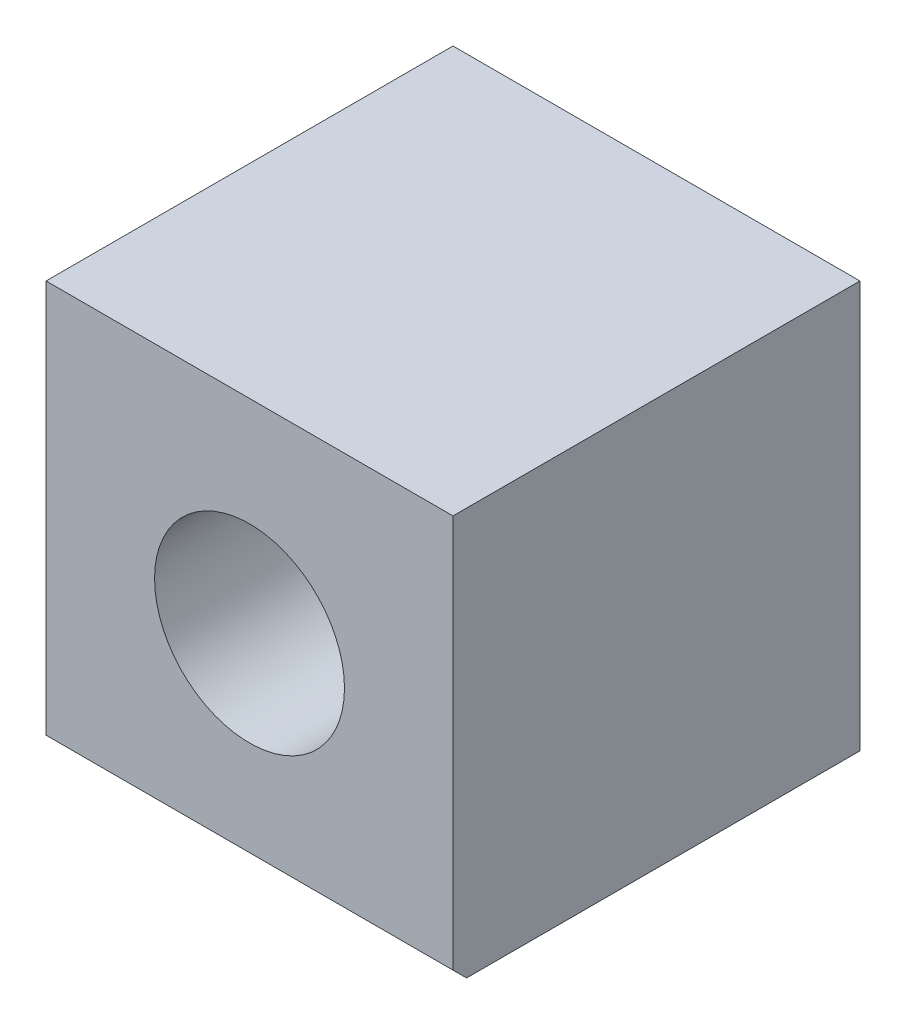
ISO-10303-21;
HEADER;
FILE_DESCRIPTION(('STEP AP214'),'2;1');
FILE_NAME('part.step','',(''),(''),'','','');
FILE_SCHEMA(('AUTOMOTIVE_DESIGN { 1 0 10303 214 1 1 1 1 }'));
ENDSEC;
DATA;
#1=APPLICATION_CONTEXT('core data for automotive mechanical design processes');
#2=APPLICATION_PROTOCOL_DEFINITION('international standard','automotive_design',2000,#1);
#3=PRODUCT_CONTEXT('',#1,'mechanical');
#4=PRODUCT('Part','Part','',(#3));
#5=PRODUCT_RELATED_PRODUCT_CATEGORY('part','',(#4));
#6=PRODUCT_DEFINITION_FORMATION('','',#4);
#7=PRODUCT_DEFINITION_CONTEXT('part definition',#1,'design');
#8=PRODUCT_DEFINITION('design','',#6,#7);
#9=PRODUCT_DEFINITION_SHAPE('','',#8);
#10=(LENGTH_UNIT() NAMED_UNIT(*) SI_UNIT(.MILLI.,.METRE.));
#11=(NAMED_UNIT(*) PLANE_ANGLE_UNIT() SI_UNIT($,.RADIAN.));
#12=(NAMED_UNIT(*) SI_UNIT($,.STERADIAN.) SOLID_ANGLE_UNIT());
#13=UNCERTAINTY_MEASURE_WITH_UNIT(LENGTH_MEASURE(1.E-05),#10,'distance_accuracy_value','');
#14=(GEOMETRIC_REPRESENTATION_CONTEXT(3) GLOBAL_UNCERTAINTY_ASSIGNED_CONTEXT((#13)) GLOBAL_UNIT_ASSIGNED_CONTEXT((#10,
#11,#12)) REPRESENTATION_CONTEXT('',''));
#15=CARTESIAN_POINT('',(0.,0.,0.));
#16=DIRECTION('',(0.,0.,1.));
#17=DIRECTION('',(1.,0.,0.));
#18=AXIS2_PLACEMENT_3D('',#15,#16,#17);
#19=CARTESIAN_POINT('',(-2.77884564684904,2.89301310043668,6.));
#20=DIRECTION('',(1.,0.,0.));
#21=DIRECTION('',(0.,1.,0.));
#22=AXIS2_PLACEMENT_3D('',#19,#20,#21);
#23=PLANE('',#22);
#24=DIRECTION('',(0.,0.,-1.));
#25=VECTOR('',#24,1.);
#26=CARTESIAN_POINT('',(-2.77884564684904,-3.10698689956332,6.));
#27=LINE('',#26,#25);
#28=CARTESIAN_POINT('',(-2.77884564684904,-3.10698689956332,5.8));
#29=VERTEX_POINT('',#28);
#30=CARTESIAN_POINT('',(-2.77884564684904,-3.10698689956332,0.));
#31=VERTEX_POINT('',#30);
#32=EDGE_CURVE('E11',#29,#31,#27,.T.);
#33=ORIENTED_EDGE('',*,*,#32,.F.);
#34=DIRECTION('',(0.,0.707106781186548,0.707106781186547));
#35=VECTOR('',#34,1.);
#36=CARTESIAN_POINT('',(-2.77884564684904,-2.90698689956332,6.));
#37=LINE('',#36,#35);
#38=CARTESIAN_POINT('',(-2.77884564684904,-2.90698689956332,6.));
#39=VERTEX_POINT('',#38);
#40=EDGE_CURVE('E118',#29,#39,#37,.T.);
#41=ORIENTED_EDGE('',*,*,#40,.T.);
#42=DIRECTION('',(0.,-1.,0.));
#43=VECTOR('',#42,1.);
#44=CARTESIAN_POINT('',(-2.77884564684904,2.89301310043668,6.));
#45=LINE('',#44,#43);
#46=CARTESIAN_POINT('',(-2.77884564684904,2.89301310043668,6.));
#47=VERTEX_POINT('',#46);
#48=EDGE_CURVE('E84',#47,#39,#45,.T.);
#49=ORIENTED_EDGE('',*,*,#48,.F.);
#50=DIRECTION('',(0.,0.,-1.));
#51=VECTOR('',#50,1.);
#52=CARTESIAN_POINT('',(-2.77884564684904,2.89301310043668,6.));
#53=LINE('',#52,#51);
#54=CARTESIAN_POINT('',(-2.77884564684904,2.89301310043668,0.));
#55=VERTEX_POINT('',#54);
#56=EDGE_CURVE('E77',#47,#55,#53,.T.);
#57=ORIENTED_EDGE('',*,*,#56,.T.);
#58=DIRECTION('',(0.,-1.,0.));
#59=VECTOR('',#58,1.);
#60=CARTESIAN_POINT('',(-2.77884564684904,2.89301310043668,0.));
#61=LINE('',#60,#59);
#62=EDGE_CURVE('E90',#55,#31,#61,.T.);
#63=ORIENTED_EDGE('',*,*,#62,.T.);
#64=EDGE_LOOP('',(#33,#41,#49,#57,#63));
#65=FACE_BOUND('',#64,.T.);
#66=ADVANCED_FACE('F33',(#65),#23,.F.);
#67=CARTESIAN_POINT('',(-2.77884564684904,-3.10698689956332,6.));
#68=DIRECTION('',(0.,1.,0.));
#69=DIRECTION('',(0.,0.,1.));
#70=AXIS2_PLACEMENT_3D('',#67,#68,#69);
#71=PLANE('',#70);
#72=DIRECTION('',(0.,0.,-1.));
#73=VECTOR('',#72,1.);
#74=CARTESIAN_POINT('',(3.22115435315096,-3.10698689956332,6.));
#75=LINE('',#74,#73);
#76=CARTESIAN_POINT('',(3.22115435315096,-3.10698689956332,5.8));
#77=VERTEX_POINT('',#76);
#78=CARTESIAN_POINT('',(3.22115435315096,-3.10698689956332,0.));
#79=VERTEX_POINT('',#78);
#80=EDGE_CURVE('E40',#77,#79,#75,.T.);
#81=ORIENTED_EDGE('',*,*,#80,.F.);
#82=DIRECTION('',(1.,0.,0.));
#83=VECTOR('',#82,1.);
#84=CARTESIAN_POINT('',(-2.77884564684904,-3.10698689956332,5.8));
#85=LINE('',#84,#83);
#86=EDGE_CURVE('E116',#29,#77,#85,.T.);
#87=ORIENTED_EDGE('',*,*,#86,.F.);
#88=ORIENTED_EDGE('',*,*,#32,.T.);
#89=DIRECTION('',(1.,0.,0.));
#90=VECTOR('',#89,1.);
#91=CARTESIAN_POINT('',(-2.77884564684904,-3.10698689956332,0.));
#92=LINE('',#91,#90);
#93=EDGE_CURVE('E96',#31,#79,#92,.T.);
#94=ORIENTED_EDGE('',*,*,#93,.T.);
#95=EDGE_LOOP('',(#81,#87,#88,#94));
#96=FACE_BOUND('',#95,.T.);
#97=ADVANCED_FACE('F114',(#96),#71,.F.);
#98=CARTESIAN_POINT('',(3.22115435315096,2.89301310043668,6.));
#99=DIRECTION('',(-1.,0.,0.));
#100=DIRECTION('',(0.,-1.,0.));
#101=AXIS2_PLACEMENT_3D('',#98,#99,#100);
#102=PLANE('',#101);
#103=DIRECTION('',(0.,1.,0.));
#104=VECTOR('',#103,1.);
#105=CARTESIAN_POINT('',(3.22115435315096,2.89301310043668,6.));
#106=LINE('',#105,#104);
#107=CARTESIAN_POINT('',(3.22115435315096,-2.90698689956332,6.));
#108=VERTEX_POINT('',#107);
#109=CARTESIAN_POINT('',(3.22115435315096,2.89301310043668,6.));
#110=VERTEX_POINT('',#109);
#111=EDGE_CURVE('E130',#108,#110,#106,.T.);
#112=ORIENTED_EDGE('',*,*,#111,.F.);
#113=DIRECTION('',(0.,0.707106781186548,0.707106781186547));
#114=VECTOR('',#113,1.);
#115=CARTESIAN_POINT('',(3.22115435315096,-2.90698689956332,6.));
#116=LINE('',#115,#114);
#117=EDGE_CURVE('E47',#77,#108,#116,.T.);
#118=ORIENTED_EDGE('',*,*,#117,.F.);
#119=ORIENTED_EDGE('',*,*,#80,.T.);
#120=DIRECTION('',(0.,1.,0.));
#121=VECTOR('',#120,1.);
#122=CARTESIAN_POINT('',(3.22115435315096,2.89301310043668,0.));
#123=LINE('',#122,#121);
#124=CARTESIAN_POINT('',(3.22115435315096,2.89301310043668,0.));
#125=VERTEX_POINT('',#124);
#126=EDGE_CURVE('E85',#79,#125,#123,.T.);
#127=ORIENTED_EDGE('',*,*,#126,.T.);
#128=DIRECTION('',(0.,0.,-1.));
#129=VECTOR('',#128,1.);
#130=CARTESIAN_POINT('',(3.22115435315096,2.89301310043668,6.));
#131=LINE('',#130,#129);
#132=EDGE_CURVE('E80',#110,#125,#131,.T.);
#133=ORIENTED_EDGE('',*,*,#132,.F.);
#134=EDGE_LOOP('',(#112,#118,#119,#127,#133));
#135=FACE_BOUND('',#134,.T.);
#136=ADVANCED_FACE('F110',(#135),#102,.F.);
#137=CARTESIAN_POINT('',(-2.77884564684904,2.89301310043668,6.));
#138=DIRECTION('',(0.,-1.,0.));
#139=DIRECTION('',(0.,0.,-1.));
#140=AXIS2_PLACEMENT_3D('',#137,#138,#139);
#141=PLANE('',#140);
#142=DIRECTION('',(-1.,0.,0.));
#143=VECTOR('',#142,1.);
#144=CARTESIAN_POINT('',(-2.77884564684904,2.89301310043668,0.));
#145=LINE('',#144,#143);
#146=EDGE_CURVE('E74',#125,#55,#145,.T.);
#147=ORIENTED_EDGE('',*,*,#146,.T.);
#148=ORIENTED_EDGE('',*,*,#56,.F.);
#149=DIRECTION('',(-1.,0.,0.));
#150=VECTOR('',#149,1.);
#151=CARTESIAN_POINT('',(-2.77884564684904,2.89301310043668,6.));
#152=LINE('',#151,#150);
#153=EDGE_CURVE('E56',#110,#47,#152,.T.);
#154=ORIENTED_EDGE('',*,*,#153,.F.);
#155=ORIENTED_EDGE('',*,*,#132,.T.);
#156=EDGE_LOOP('',(#147,#148,#154,#155));
#157=FACE_BOUND('',#156,.T.);
#158=ADVANCED_FACE('F76',(#157),#141,.F.);
#159=CARTESIAN_POINT('',(0.,0.,6.));
#160=DIRECTION('',(0.,0.,1.));
#161=DIRECTION('',(1.,0.,0.));
#162=AXIS2_PLACEMENT_3D('',#159,#160,#161);
#163=PLANE('',#162);
#164=DIRECTION('',(1.,0.,0.));
#165=VECTOR('',#164,1.);
#166=CARTESIAN_POINT('',(-2.77884564684904,-2.90698689956332,6.));
#167=LINE('',#166,#165);
#168=EDGE_CURVE('E122',#39,#108,#167,.T.);
#169=ORIENTED_EDGE('',*,*,#168,.T.);
#170=ORIENTED_EDGE('',*,*,#111,.T.);
#171=ORIENTED_EDGE('',*,*,#153,.T.);
#172=ORIENTED_EDGE('',*,*,#48,.T.);
#173=EDGE_LOOP('',(#169,#170,#171,#172));
#174=FACE_BOUND('',#173,.T.);
#175=CARTESIAN_POINT('',(0.221154353150962,-0.106986899563318,6.));
#176=DIRECTION('',(0.,0.,1.));
#177=DIRECTION('',(1.,0.,0.));
#178=AXIS2_PLACEMENT_3D('',#175,#176,#177);
#179=CIRCLE('',#178,1.4);
#180=CARTESIAN_POINT('',(1.62115435315096,-0.106986899563318,6.));
#181=VERTEX_POINT('',#180);
#182=EDGE_CURVE('E101',#181,#181,#179,.T.);
#183=ORIENTED_EDGE('',*,*,#182,.F.);
#184=EDGE_LOOP('',(#183));
#185=FACE_BOUND('',#184,.T.);
#186=ADVANCED_FACE('F131',(#174,#185),#163,.T.);
#187=CARTESIAN_POINT('',(0.,0.,0.));
#188=DIRECTION('',(0.,0.,1.));
#189=DIRECTION('',(1.,0.,0.));
#190=AXIS2_PLACEMENT_3D('',#187,#188,#189);
#191=PLANE('',#190);
#192=CARTESIAN_POINT('',(0.221154353150962,-0.106986899563318,0.));
#193=DIRECTION('',(0.,0.,1.));
#194=DIRECTION('',(1.,0.,0.));
#195=AXIS2_PLACEMENT_3D('',#192,#193,#194);
#196=CIRCLE('',#195,1.4);
#197=CARTESIAN_POINT('',(1.62115435315096,-0.106986899563318,0.));
#198=VERTEX_POINT('',#197);
#199=EDGE_CURVE('E97',#198,#198,#196,.T.);
#200=ORIENTED_EDGE('',*,*,#199,.T.);
#201=EDGE_LOOP('',(#200));
#202=FACE_BOUND('',#201,.T.);
#203=ORIENTED_EDGE('',*,*,#62,.F.);
#204=ORIENTED_EDGE('',*,*,#146,.F.);
#205=ORIENTED_EDGE('',*,*,#126,.F.);
#206=ORIENTED_EDGE('',*,*,#93,.F.);
#207=EDGE_LOOP('',(#203,#204,#205,#206));
#208=FACE_BOUND('',#207,.T.);
#209=ADVANCED_FACE('F94',(#202,#208),#191,.F.);
#210=CARTESIAN_POINT('',(0.221154353150962,-0.106986899563318,0.));
#211=DIRECTION('',(0.,0.,1.));
#212=DIRECTION('',(1.,0.,0.));
#213=AXIS2_PLACEMENT_3D('',#210,#211,#212);
#214=CYLINDRICAL_SURFACE('',#213,1.4);
#215=ORIENTED_EDGE('',*,*,#199,.F.);
#216=EDGE_LOOP('',(#215));
#217=FACE_BOUND('',#216,.T.);
#218=ORIENTED_EDGE('',*,*,#182,.T.);
#219=EDGE_LOOP('',(#218));
#220=FACE_BOUND('',#219,.T.);
#221=ADVANCED_FACE('F137',(#217,#220),#214,.F.);
#222=CARTESIAN_POINT('',(-2.77884564684904,-2.90698689956332,6.));
#223=DIRECTION('',(0.,0.707106781186547,-0.707106781186548));
#224=DIRECTION('',(0.,0.707106781186548,0.707106781186547));
#225=AXIS2_PLACEMENT_3D('',#222,#223,#224);
#226=PLANE('',#225);
#227=ORIENTED_EDGE('',*,*,#117,.T.);
#228=ORIENTED_EDGE('',*,*,#168,.F.);
#229=ORIENTED_EDGE('',*,*,#40,.F.);
#230=ORIENTED_EDGE('',*,*,#86,.T.);
#231=EDGE_LOOP('',(#227,#228,#229,#230));
#232=FACE_BOUND('',#231,.T.);
#233=ADVANCED_FACE('F121',(#232),#226,.F.);
#234=CLOSED_SHELL('',(#66,#97,#136,#158,#186,#209,#221,#233));
#235=MANIFOLD_SOLID_BREP('B2',#234);
#236=ADVANCED_BREP_SHAPE_REPRESENTATION('',(#18,#235),#14);
#237=SHAPE_DEFINITION_REPRESENTATION(#9,#236);
ENDSEC;
END-ISO-10303-21;
